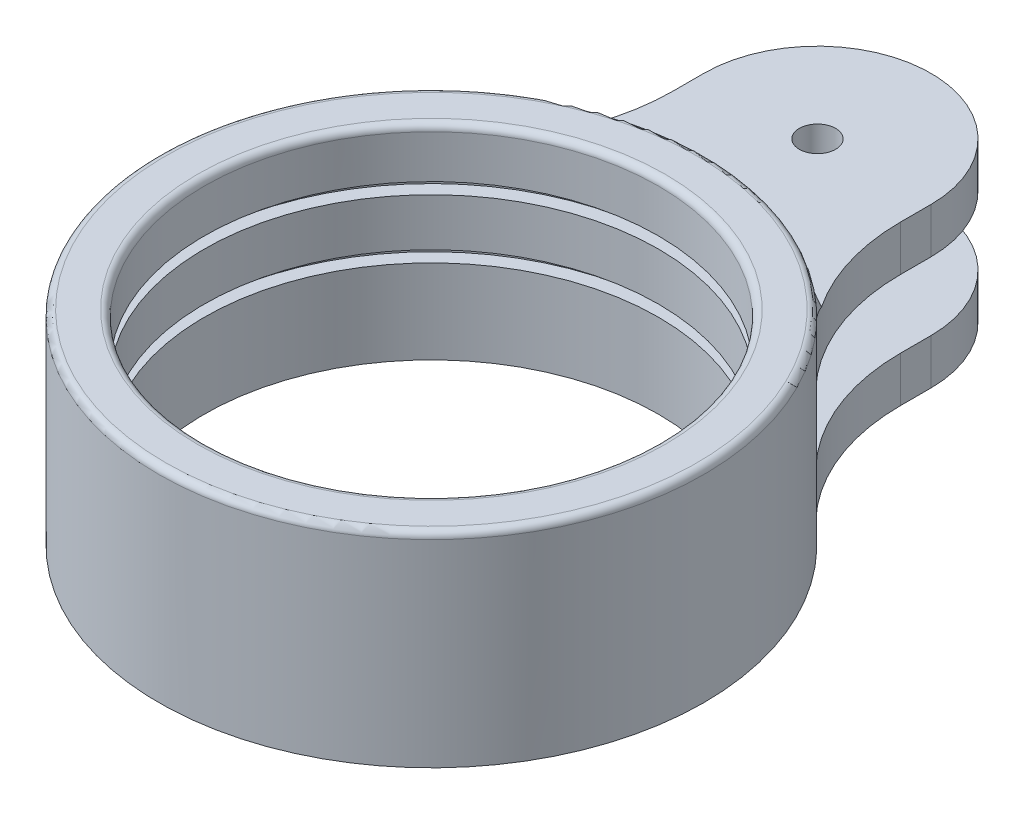
ISO-10303-21;
HEADER;
FILE_DESCRIPTION(('STEP AP214'),'2;1');
FILE_NAME('part.step','',(''),(''),'','','');
FILE_SCHEMA(('AUTOMOTIVE_DESIGN { 1 0 10303 214 1 1 1 1 }'));
ENDSEC;
DATA;
#1=APPLICATION_CONTEXT('core data for automotive mechanical design processes');
#2=APPLICATION_PROTOCOL_DEFINITION('international standard','automotive_design',2000,#1);
#3=PRODUCT_CONTEXT('',#1,'mechanical');
#4=PRODUCT('Part','Part','',(#3));
#5=PRODUCT_RELATED_PRODUCT_CATEGORY('part','',(#4));
#6=PRODUCT_DEFINITION_FORMATION('','',#4);
#7=PRODUCT_DEFINITION_CONTEXT('part definition',#1,'design');
#8=PRODUCT_DEFINITION('design','',#6,#7);
#9=PRODUCT_DEFINITION_SHAPE('','',#8);
#10=(LENGTH_UNIT() NAMED_UNIT(*) SI_UNIT(.MILLI.,.METRE.));
#11=(NAMED_UNIT(*) PLANE_ANGLE_UNIT() SI_UNIT($,.RADIAN.));
#12=(NAMED_UNIT(*) SI_UNIT($,.STERADIAN.) SOLID_ANGLE_UNIT());
#13=UNCERTAINTY_MEASURE_WITH_UNIT(LENGTH_MEASURE(1.E-05),#10,'distance_accuracy_value','');
#14=(GEOMETRIC_REPRESENTATION_CONTEXT(3) GLOBAL_UNCERTAINTY_ASSIGNED_CONTEXT((#13)) GLOBAL_UNIT_ASSIGNED_CONTEXT((#10,
#11,#12)) REPRESENTATION_CONTEXT('',''));
#15=CARTESIAN_POINT('',(0.,0.,0.));
#16=DIRECTION('',(0.,0.,1.));
#17=DIRECTION('',(1.,0.,0.));
#18=AXIS2_PLACEMENT_3D('',#15,#16,#17);
#19=CARTESIAN_POINT('',(0.,45.,0.));
#20=DIRECTION('',(0.,-1.,0.));
#21=DIRECTION('',(0.,0.,-1.));
#22=AXIS2_PLACEMENT_3D('',#19,#20,#21);
#23=CYLINDRICAL_SURFACE('',#22,50.);
#24=CARTESIAN_POINT('',(0.,21.,0.));
#25=DIRECTION('',(0.,1.,0.));
#26=DIRECTION('',(0.,0.,1.));
#27=AXIS2_PLACEMENT_3D('',#24,#25,#26);
#28=CIRCLE('',#27,50.);
#29=CARTESIAN_POINT('',(0.,21.,-50.));
#30=VERTEX_POINT('',#29);
#31=EDGE_CURVE('E267',#30,#30,#28,.T.);
#32=CARTESIAN_POINT('',(0.,31.5,0.));
#33=DIRECTION('',(0.,1.,0.));
#34=DIRECTION('',(0.,0.,1.));
#35=AXIS2_PLACEMENT_3D('',#32,#33,#34);
#36=CIRCLE('',#35,50.);
#37=CARTESIAN_POINT('',(0.,31.5,-50.));
#38=VERTEX_POINT('',#37);
#39=EDGE_CURVE('E248',#38,#38,#36,.T.);
#40=CARTESIAN_POINT('',(0.,21.,-50.));
#41=CARTESIAN_POINT('',(0.,21.109375,-50.));
#42=CARTESIAN_POINT('',(0.,21.21875,-50.));
#43=CARTESIAN_POINT('',(0.,21.4375,-50.));
#44=CARTESIAN_POINT('',(0.,21.546875,-50.));
#45=CARTESIAN_POINT('',(0.,21.765625,-50.));
#46=CARTESIAN_POINT('',(0.,21.875,-50.));
#47=CARTESIAN_POINT('',(0.,22.09375,-50.));
#48=CARTESIAN_POINT('',(0.,22.203125,-50.));
#49=CARTESIAN_POINT('',(0.,22.421875,-50.));
#50=CARTESIAN_POINT('',(0.,22.53125,-50.));
#51=CARTESIAN_POINT('',(0.,22.75,-50.));
#52=CARTESIAN_POINT('',(0.,22.859375,-50.));
#53=CARTESIAN_POINT('',(0.,23.078125,-50.));
#54=CARTESIAN_POINT('',(0.,23.1875,-50.));
#55=CARTESIAN_POINT('',(0.,23.40625,-50.));
#56=CARTESIAN_POINT('',(0.,23.515625,-50.));
#57=CARTESIAN_POINT('',(0.,23.734375,-50.));
#58=CARTESIAN_POINT('',(0.,23.84375,-50.));
#59=CARTESIAN_POINT('',(0.,24.0625,-50.));
#60=CARTESIAN_POINT('',(0.,24.171875,-50.));
#61=CARTESIAN_POINT('',(0.,24.390625,-50.));
#62=CARTESIAN_POINT('',(0.,24.5,-50.));
#63=CARTESIAN_POINT('',(0.,24.71875,-50.));
#64=CARTESIAN_POINT('',(0.,24.828125,-50.));
#65=CARTESIAN_POINT('',(0.,25.046875,-50.));
#66=CARTESIAN_POINT('',(0.,25.15625,-50.));
#67=CARTESIAN_POINT('',(0.,25.375,-50.));
#68=CARTESIAN_POINT('',(0.,25.484375,-50.));
#69=CARTESIAN_POINT('',(0.,25.703125,-50.));
#70=CARTESIAN_POINT('',(0.,25.8125,-50.));
#71=CARTESIAN_POINT('',(0.,26.03125,-50.));
#72=CARTESIAN_POINT('',(0.,26.140625,-50.));
#73=CARTESIAN_POINT('',(0.,26.359375,-50.));
#74=CARTESIAN_POINT('',(0.,26.46875,-50.));
#75=CARTESIAN_POINT('',(0.,26.6875,-50.));
#76=CARTESIAN_POINT('',(0.,26.796875,-50.));
#77=CARTESIAN_POINT('',(0.,27.015625,-50.));
#78=CARTESIAN_POINT('',(0.,27.125,-50.));
#79=CARTESIAN_POINT('',(0.,27.34375,-50.));
#80=CARTESIAN_POINT('',(0.,27.453125,-50.));
#81=CARTESIAN_POINT('',(0.,27.671875,-50.));
#82=CARTESIAN_POINT('',(0.,27.78125,-50.));
#83=CARTESIAN_POINT('',(0.,28.,-50.));
#84=CARTESIAN_POINT('',(0.,28.109375,-50.));
#85=CARTESIAN_POINT('',(0.,28.328125,-50.));
#86=CARTESIAN_POINT('',(0.,28.4375,-50.));
#87=CARTESIAN_POINT('',(0.,28.65625,-50.));
#88=CARTESIAN_POINT('',(0.,28.765625,-50.));
#89=CARTESIAN_POINT('',(0.,28.984375,-50.));
#90=CARTESIAN_POINT('',(0.,29.09375,-50.));
#91=CARTESIAN_POINT('',(0.,29.3125,-50.));
#92=CARTESIAN_POINT('',(0.,29.421875,-50.));
#93=CARTESIAN_POINT('',(0.,29.640625,-50.));
#94=CARTESIAN_POINT('',(0.,29.75,-50.));
#95=CARTESIAN_POINT('',(0.,29.96875,-50.));
#96=CARTESIAN_POINT('',(0.,30.078125,-50.));
#97=CARTESIAN_POINT('',(0.,30.296875,-50.));
#98=CARTESIAN_POINT('',(0.,30.40625,-50.));
#99=CARTESIAN_POINT('',(0.,30.625,-50.));
#100=CARTESIAN_POINT('',(0.,30.734375,-50.));
#101=CARTESIAN_POINT('',(0.,30.953125,-50.));
#102=CARTESIAN_POINT('',(0.,31.0625,-50.));
#103=CARTESIAN_POINT('',(0.,31.28125,-50.));
#104=CARTESIAN_POINT('',(0.,31.390625,-50.));
#105=CARTESIAN_POINT('',(0.,31.5,-50.));
#106=B_SPLINE_CURVE_WITH_KNOTS('',3,(#40,#41,#42,#43,#44,#45,#46,#47,#48,#49,#50,#51,#52,#53,
#54,#55,#56,#57,#58,#59,#60,#61,#62,#63,#64,#65,#66,#67,#68,#69,#70,#71,#72,#73,#74,#75,#76,#77,
#78,#79,#80,#81,#82,#83,#84,#85,#86,#87,#88,#89,#90,#91,#92,#93,#94,#95,#96,#97,#98,#99,#100,
#101,#102,#103,#104,#105),.UNSPECIFIED.,.F.,.F.,(4,2,2,2,2,2,2,2,2,2,2,2,2,2,2,2,2,2,2,2,2,2,2,
2,2,2,2,2,2,2,2,2,4),(0.,0.328124999999999,0.656250000000001,0.984374999999999,1.3125,1.640625,
1.96875,2.296875,2.625,2.953125,3.28125,3.609375,3.9375,4.265625,4.59375,4.921875,5.25,5.578125,
5.90625,6.234375,6.5625,6.890625,7.21875,7.546875,7.875,8.203125,8.53125,8.859375,9.1875,
9.515625,9.84375,10.171875,10.5),.UNSPECIFIED.);
#107=EDGE_CURVE('BSEAM37',#30,#38,#106,.T.);
#108=ORIENTED_EDGE('',*,*,#31,.F.);
#109=ORIENTED_EDGE('',*,*,#39,.T.);
#110=ORIENTED_EDGE('',*,*,#107,.T.);
#111=ORIENTED_EDGE('',*,*,#107,.F.);
#112=EDGE_LOOP('',(#108,#110,#109,#111));
#113=FACE_BOUND('',#112,.T.);
#114=ADVANCED_FACE('F37',(#113),#23,.F.);
#115=CARTESIAN_POINT('',(0.,0.,0.));
#116=DIRECTION('',(0.,1.,0.));
#117=DIRECTION('',(0.,0.,1.));
#118=AXIS2_PLACEMENT_3D('',#115,#116,#117);
#119=CIRCLE('',#118,50.);
#120=CARTESIAN_POINT('',(0.,0.,-50.));
#121=VERTEX_POINT('',#120);
#122=EDGE_CURVE('E322',#121,#121,#119,.T.);
#123=CARTESIAN_POINT('',(0.,18.5,0.));
#124=DIRECTION('',(0.,1.,0.));
#125=DIRECTION('',(0.,0.,1.));
#126=AXIS2_PLACEMENT_3D('',#123,#124,#125);
#127=CIRCLE('',#126,50.);
#128=CARTESIAN_POINT('',(0.,18.5,-50.));
#129=VERTEX_POINT('',#128);
#130=EDGE_CURVE('E264',#129,#129,#127,.T.);
#131=CARTESIAN_POINT('',(0.,0.,-50.));
#132=CARTESIAN_POINT('',(0.,0.192708333333326,-50.));
#133=CARTESIAN_POINT('',(0.,0.385416666666659,-50.));
#134=CARTESIAN_POINT('',(0.,0.770833333333325,-50.));
#135=CARTESIAN_POINT('',(0.,0.963541666666658,-50.));
#136=CARTESIAN_POINT('',(0.,1.34895833333333,-50.));
#137=CARTESIAN_POINT('',(0.,1.54166666666666,-50.));
#138=CARTESIAN_POINT('',(0.,1.92708333333333,-50.));
#139=CARTESIAN_POINT('',(0.,2.11979166666666,-50.));
#140=CARTESIAN_POINT('',(0.,2.50520833333333,-50.));
#141=CARTESIAN_POINT('',(0.,2.69791666666666,-50.));
#142=CARTESIAN_POINT('',(0.,3.08333333333333,-50.));
#143=CARTESIAN_POINT('',(0.,3.27604166666666,-50.));
#144=CARTESIAN_POINT('',(0.,3.66145833333333,-50.));
#145=CARTESIAN_POINT('',(0.,3.85416666666666,-50.));
#146=CARTESIAN_POINT('',(0.,4.23958333333333,-50.));
#147=CARTESIAN_POINT('',(0.,4.43229166666666,-50.));
#148=CARTESIAN_POINT('',(0.,4.81770833333333,-50.));
#149=CARTESIAN_POINT('',(0.,5.01041666666666,-50.));
#150=CARTESIAN_POINT('',(0.,5.39583333333333,-50.));
#151=CARTESIAN_POINT('',(0.,5.58854166666666,-50.));
#152=CARTESIAN_POINT('',(0.,5.97395833333333,-50.));
#153=CARTESIAN_POINT('',(0.,6.16666666666666,-50.));
#154=CARTESIAN_POINT('',(0.,6.55208333333333,-50.));
#155=CARTESIAN_POINT('',(0.,6.74479166666666,-50.));
#156=CARTESIAN_POINT('',(0.,7.13020833333333,-50.));
#157=CARTESIAN_POINT('',(0.,7.32291666666667,-50.));
#158=CARTESIAN_POINT('',(0.,7.70833333333333,-50.));
#159=CARTESIAN_POINT('',(0.,7.90104166666666,-50.));
#160=CARTESIAN_POINT('',(0.,8.28645833333333,-50.));
#161=CARTESIAN_POINT('',(0.,8.47916666666666,-50.));
#162=CARTESIAN_POINT('',(0.,8.86458333333333,-50.));
#163=CARTESIAN_POINT('',(0.,9.05729166666667,-50.));
#164=CARTESIAN_POINT('',(0.,9.44270833333333,-50.));
#165=CARTESIAN_POINT('',(0.,9.63541666666667,-50.));
#166=CARTESIAN_POINT('',(0.,10.0208333333333,-50.));
#167=CARTESIAN_POINT('',(0.,10.2135416666667,-50.));
#168=CARTESIAN_POINT('',(0.,10.5989583333333,-50.));
#169=CARTESIAN_POINT('',(0.,10.7916666666667,-50.));
#170=CARTESIAN_POINT('',(0.,11.1770833333333,-50.));
#171=CARTESIAN_POINT('',(0.,11.3697916666667,-50.));
#172=CARTESIAN_POINT('',(0.,11.7552083333333,-50.));
#173=CARTESIAN_POINT('',(0.,11.9479166666667,-50.));
#174=CARTESIAN_POINT('',(0.,12.3333333333333,-50.));
#175=CARTESIAN_POINT('',(0.,12.5260416666667,-50.));
#176=CARTESIAN_POINT('',(0.,12.9114583333333,-50.));
#177=CARTESIAN_POINT('',(0.,13.1041666666667,-50.));
#178=CARTESIAN_POINT('',(0.,13.4895833333333,-50.));
#179=CARTESIAN_POINT('',(0.,13.6822916666667,-50.));
#180=CARTESIAN_POINT('',(0.,14.0677083333333,-50.));
#181=CARTESIAN_POINT('',(0.,14.2604166666667,-50.));
#182=CARTESIAN_POINT('',(0.,14.6458333333333,-50.));
#183=CARTESIAN_POINT('',(0.,14.8385416666667,-50.));
#184=CARTESIAN_POINT('',(0.,15.2239583333333,-50.));
#185=CARTESIAN_POINT('',(0.,15.4166666666667,-50.));
#186=CARTESIAN_POINT('',(0.,15.8020833333333,-50.));
#187=CARTESIAN_POINT('',(0.,15.9947916666667,-50.));
#188=CARTESIAN_POINT('',(0.,16.3802083333333,-50.));
#189=CARTESIAN_POINT('',(0.,16.5729166666667,-50.));
#190=CARTESIAN_POINT('',(0.,16.9583333333333,-50.));
#191=CARTESIAN_POINT('',(0.,17.1510416666667,-50.));
#192=CARTESIAN_POINT('',(0.,17.5364583333333,-50.));
#193=CARTESIAN_POINT('',(0.,17.7291666666667,-50.));
#194=CARTESIAN_POINT('',(0.,18.1145833333333,-50.));
#195=CARTESIAN_POINT('',(0.,18.3072916666667,-50.));
#196=CARTESIAN_POINT('',(0.,18.5,-50.));
#197=B_SPLINE_CURVE_WITH_KNOTS('',3,(#131,#132,#133,#134,#135,#136,#137,#138,#139,#140,#141,
#142,#143,#144,#145,#146,#147,#148,#149,#150,#151,#152,#153,#154,#155,#156,#157,#158,#159,#160,
#161,#162,#163,#164,#165,#166,#167,#168,#169,#170,#171,#172,#173,#174,#175,#176,#177,#178,#179,
#180,#181,#182,#183,#184,#185,#186,#187,#188,#189,#190,#191,#192,#193,#194,#195,#196),
.UNSPECIFIED.,.F.,.F.,(4,2,2,2,2,2,2,2,2,2,2,2,2,2,2,2,2,2,2,2,2,2,2,2,2,2,2,2,2,2,2,2,4),(0.,
0.578124999999999,1.15625,1.734375,2.3125,2.890625,3.46875,4.04687500000001,4.625,5.203125,
5.78125,6.359375,6.93750000000001,7.51562500000001,8.09375,8.671875,9.25000000000001,
9.82812500000001,10.40625,10.984375,11.5625,12.140625,12.71875,13.296875,13.875,14.453125,
15.03125,15.609375,16.1875,16.765625,17.34375,17.921875,18.5),.UNSPECIFIED.);
#198=EDGE_CURVE('BSEAM215',#121,#129,#197,.T.);
#199=ORIENTED_EDGE('',*,*,#122,.F.);
#200=ORIENTED_EDGE('',*,*,#130,.T.);
#201=ORIENTED_EDGE('',*,*,#198,.T.);
#202=ORIENTED_EDGE('',*,*,#198,.F.);
#203=EDGE_LOOP('',(#199,#201,#200,#202));
#204=FACE_BOUND('',#203,.T.);
#205=ADVANCED_FACE('F215',(#204),#23,.F.);
#206=CARTESIAN_POINT('',(0.,35.,-85.));
#207=DIRECTION('',(0.,-1.,0.));
#208=DIRECTION('',(0.,0.,-1.));
#209=AXIS2_PLACEMENT_3D('',#206,#207,#208);
#210=CYLINDRICAL_SURFACE('',#209,25.);
#211=CARTESIAN_POINT('',(0.,10.,-85.));
#212=DIRECTION('',(0.,1.,0.));
#213=DIRECTION('',(0.,0.,1.));
#214=AXIS2_PLACEMENT_3D('',#211,#212,#213);
#215=CIRCLE('',#214,25.);
#216=CARTESIAN_POINT('',(25.,10.,-85.));
#217=VERTEX_POINT('',#216);
#218=CARTESIAN_POINT('',(-25.,10.,-85.));
#219=VERTEX_POINT('',#218);
#220=EDGE_CURVE('E285',#217,#219,#215,.T.);
#221=ORIENTED_EDGE('',*,*,#220,.F.);
#222=DIRECTION('',(0.,-1.,0.));
#223=VECTOR('',#222,1.);
#224=CARTESIAN_POINT('',(25.,35.,-85.));
#225=LINE('',#224,#223);
#226=CARTESIAN_POINT('',(25.,0.,-85.));
#227=VERTEX_POINT('',#226);
#228=EDGE_CURVE('E307',#217,#227,#225,.T.);
#229=ORIENTED_EDGE('',*,*,#228,.T.);
#230=CARTESIAN_POINT('',(0.,0.,-85.));
#231=DIRECTION('',(0.,1.,0.));
#232=DIRECTION('',(0.,0.,1.));
#233=AXIS2_PLACEMENT_3D('',#230,#231,#232);
#234=CIRCLE('',#233,25.);
#235=CARTESIAN_POINT('',(-25.,0.,-85.));
#236=VERTEX_POINT('',#235);
#237=EDGE_CURVE('E146',#227,#236,#234,.T.);
#238=ORIENTED_EDGE('',*,*,#237,.T.);
#239=DIRECTION('',(0.,-1.,0.));
#240=VECTOR('',#239,1.);
#241=CARTESIAN_POINT('',(-25.,35.,-85.));
#242=LINE('',#241,#240);
#243=EDGE_CURVE('E318',#219,#236,#242,.T.);
#244=ORIENTED_EDGE('',*,*,#243,.F.);
#245=EDGE_LOOP('',(#221,#229,#238,#244));
#246=FACE_BOUND('',#245,.T.);
#247=ADVANCED_FACE('F222',(#246),#210,.T.);
#248=CARTESIAN_POINT('',(-25.,35.,-85.));
#249=DIRECTION('',(1.,0.,0.));
#250=DIRECTION('',(0.,0.,-1.));
#251=AXIS2_PLACEMENT_3D('',#248,#249,#250);
#252=PLANE('',#251);
#253=DIRECTION('',(0.,0.,1.));
#254=VECTOR('',#253,1.);
#255=CARTESIAN_POINT('',(-25.,10.,-85.));
#256=LINE('',#255,#254);
#257=CARTESIAN_POINT('',(-25.,10.,-78.2623792124926));
#258=VERTEX_POINT('',#257);
#259=EDGE_CURVE('E287',#219,#258,#256,.T.);
#260=ORIENTED_EDGE('',*,*,#259,.F.);
#261=ORIENTED_EDGE('',*,*,#243,.T.);
#262=DIRECTION('',(0.,0.,1.));
#263=VECTOR('',#262,1.);
#264=CARTESIAN_POINT('',(-25.,0.,-85.));
#265=LINE('',#264,#263);
#266=CARTESIAN_POINT('',(-25.,0.,-78.2623792124926));
#267=VERTEX_POINT('',#266);
#268=EDGE_CURVE('E310',#236,#267,#265,.T.);
#269=ORIENTED_EDGE('',*,*,#268,.T.);
#270=DIRECTION('',(0.,1.,0.));
#271=VECTOR('',#270,1.);
#272=CARTESIAN_POINT('',(-25.,35.,-78.2623792124926));
#273=LINE('',#272,#271);
#274=EDGE_CURVE('E156',#267,#258,#273,.T.);
#275=ORIENTED_EDGE('',*,*,#274,.T.);
#276=EDGE_LOOP('',(#260,#261,#269,#275));
#277=FACE_BOUND('',#276,.T.);
#278=ADVANCED_FACE('F351',(#277),#252,.F.);
#279=CARTESIAN_POINT('',(25.,35.,-85.));
#280=DIRECTION('',(-1.,0.,0.));
#281=DIRECTION('',(0.,0.,1.));
#282=AXIS2_PLACEMENT_3D('',#279,#280,#281);
#283=PLANE('',#282);
#284=DIRECTION('',(0.,0.,-1.));
#285=VECTOR('',#284,1.);
#286=CARTESIAN_POINT('',(25.,10.,-85.));
#287=LINE('',#286,#285);
#288=CARTESIAN_POINT('',(25.,10.,-78.2623792124926));
#289=VERTEX_POINT('',#288);
#290=EDGE_CURVE('E139',#289,#217,#287,.T.);
#291=ORIENTED_EDGE('',*,*,#290,.F.);
#292=DIRECTION('',(0.,1.,0.));
#293=VECTOR('',#292,1.);
#294=CARTESIAN_POINT('',(25.,0.,-78.2623792124926));
#295=LINE('',#294,#293);
#296=CARTESIAN_POINT('',(25.,0.,-78.2623792124926));
#297=VERTEX_POINT('',#296);
#298=EDGE_CURVE('E163',#289,#297,#295,.F.);
#299=ORIENTED_EDGE('',*,*,#298,.T.);
#300=DIRECTION('',(0.,0.,-1.));
#301=VECTOR('',#300,1.);
#302=CARTESIAN_POINT('',(25.,0.,-85.));
#303=LINE('',#302,#301);
#304=EDGE_CURVE('E302',#297,#227,#303,.T.);
#305=ORIENTED_EDGE('',*,*,#304,.T.);
#306=ORIENTED_EDGE('',*,*,#228,.F.);
#307=EDGE_LOOP('',(#291,#299,#305,#306));
#308=FACE_BOUND('',#307,.T.);
#309=ADVANCED_FACE('F344',(#308),#283,.F.);
#310=CARTESIAN_POINT('',(-70.,45.,-78.2623792124926));
#311=DIRECTION('',(0.,-1.,0.));
#312=DIRECTION('',(0.,0.,-1.));
#313=AXIS2_PLACEMENT_3D('',#310,#311,#312);
#314=CYLINDRICAL_SURFACE('',#313,45.);
#315=CARTESIAN_POINT('',(-70.,10.,-78.2623792124926));
#316=DIRECTION('',(0.,1.,0.));
#317=DIRECTION('',(0.,0.,1.));
#318=AXIS2_PLACEMENT_3D('',#315,#316,#317);
#319=CIRCLE('',#318,45.);
#320=CARTESIAN_POINT('',(-40.,10.,-44.7213595499958));
#321=VERTEX_POINT('',#320);
#322=EDGE_CURVE('E289',#258,#321,#319,.F.);
#323=ORIENTED_EDGE('',*,*,#322,.F.);
#324=ORIENTED_EDGE('',*,*,#274,.F.);
#325=CARTESIAN_POINT('',(-70.,0.,-78.2623792124926));
#326=DIRECTION('',(0.,1.,0.));
#327=DIRECTION('',(0.,0.,1.));
#328=AXIS2_PLACEMENT_3D('',#325,#326,#327);
#329=CIRCLE('',#328,45.);
#330=CARTESIAN_POINT('',(-40.,0.,-44.7213595499958));
#331=VERTEX_POINT('',#330);
#332=EDGE_CURVE('E167',#331,#267,#329,.T.);
#333=ORIENTED_EDGE('',*,*,#332,.F.);
#334=DIRECTION('',(0.,-1.,0.));
#335=VECTOR('',#334,1.);
#336=CARTESIAN_POINT('',(-40.,45.,-44.7213595499958));
#337=LINE('',#336,#335);
#338=EDGE_CURVE('E154',#321,#331,#337,.T.);
#339=ORIENTED_EDGE('',*,*,#338,.F.);
#340=EDGE_LOOP('',(#323,#324,#333,#339));
#341=FACE_BOUND('',#340,.T.);
#342=ADVANCED_FACE('F356',(#341),#314,.F.);
#343=CARTESIAN_POINT('',(70.,45.,-78.2623792124926));
#344=DIRECTION('',(0.,-1.,0.));
#345=DIRECTION('',(0.,0.,-1.));
#346=AXIS2_PLACEMENT_3D('',#343,#344,#345);
#347=CYLINDRICAL_SURFACE('',#346,45.);
#348=CARTESIAN_POINT('',(70.,10.,-78.2623792124926));
#349=DIRECTION('',(0.,1.,0.));
#350=DIRECTION('',(0.,0.,1.));
#351=AXIS2_PLACEMENT_3D('',#348,#349,#350);
#352=CIRCLE('',#351,45.);
#353=CARTESIAN_POINT('',(40.,10.,-44.7213595499958));
#354=VERTEX_POINT('',#353);
#355=EDGE_CURVE('E176',#354,#289,#352,.F.);
#356=ORIENTED_EDGE('',*,*,#355,.F.);
#357=DIRECTION('',(0.,-1.,0.));
#358=VECTOR('',#357,1.);
#359=CARTESIAN_POINT('',(40.,45.,-44.7213595499958));
#360=LINE('',#359,#358);
#361=CARTESIAN_POINT('',(40.,0.,-44.7213595499958));
#362=VERTEX_POINT('',#361);
#363=EDGE_CURVE('E158',#362,#354,#360,.F.);
#364=ORIENTED_EDGE('',*,*,#363,.F.);
#365=CARTESIAN_POINT('',(70.,0.,-78.2623792124926));
#366=DIRECTION('',(0.,1.,0.));
#367=DIRECTION('',(0.,0.,1.));
#368=AXIS2_PLACEMENT_3D('',#365,#366,#367);
#369=CIRCLE('',#368,45.);
#370=EDGE_CURVE('E172',#297,#362,#369,.T.);
#371=ORIENTED_EDGE('',*,*,#370,.F.);
#372=ORIENTED_EDGE('',*,*,#298,.F.);
#373=EDGE_LOOP('',(#356,#364,#371,#372));
#374=FACE_BOUND('',#373,.T.);
#375=ADVANCED_FACE('F335',(#374),#347,.F.);
#376=CARTESIAN_POINT('',(0.,45.,0.));
#377=DIRECTION('',(0.,-1.,0.));
#378=DIRECTION('',(0.,0.,-1.));
#379=AXIS2_PLACEMENT_3D('',#376,#377,#378);
#380=CYLINDRICAL_SURFACE('',#379,60.);
#381=CARTESIAN_POINT('',(0.,43.5,0.));
#382=DIRECTION('',(0.,1.,0.));
#383=DIRECTION('',(0.,0.,1.));
#384=AXIS2_PLACEMENT_3D('',#381,#382,#383);
#385=CIRCLE('',#384,60.);
#386=CARTESIAN_POINT('',(0.,43.5,60.));
#387=VERTEX_POINT('',#386);
#388=EDGE_CURVE('E46',#387,#387,#385,.F.);
#389=ORIENTED_EDGE('',*,*,#388,.T.);
#390=EDGE_LOOP('',(#389));
#391=FACE_BOUND('',#390,.T.);
#392=CARTESIAN_POINT('',(40.,25.,-44.7213595499958));
#393=VERTEX_POINT('',#392);
#394=CARTESIAN_POINT('',(40.,37.4999999999999,-44.7213595499958));
#395=VERTEX_POINT('',#394);
#396=EDGE_CURVE('E53',#393,#395,#360,.F.);
#397=ORIENTED_EDGE('',*,*,#396,.T.);
#398=CARTESIAN_POINT('',(0.,37.4999999999999,0.));
#399=DIRECTION('',(0.,1.,0.));
#400=DIRECTION('',(0.,0.,1.));
#401=AXIS2_PLACEMENT_3D('',#398,#399,#400);
#402=CIRCLE('',#401,60.);
#403=CARTESIAN_POINT('',(-40.,37.4999999999999,-44.7213595499958));
#404=VERTEX_POINT('',#403);
#405=EDGE_CURVE('E152',#395,#404,#402,.T.);
#406=ORIENTED_EDGE('',*,*,#405,.T.);
#407=CARTESIAN_POINT('',(-40.,25.,-44.7213595499958));
#408=VERTEX_POINT('',#407);
#409=EDGE_CURVE('E61',#404,#408,#337,.T.);
#410=ORIENTED_EDGE('',*,*,#409,.T.);
#411=CARTESIAN_POINT('',(0.,25.,0.));
#412=DIRECTION('',(0.,1.,0.));
#413=DIRECTION('',(0.,0.,1.));
#414=AXIS2_PLACEMENT_3D('',#411,#412,#413);
#415=CIRCLE('',#414,60.);
#416=EDGE_CURVE('E133',#393,#408,#415,.T.);
#417=ORIENTED_EDGE('',*,*,#416,.F.);
#418=EDGE_LOOP('',(#397,#406,#410,#417));
#419=FACE_BOUND('',#418,.T.);
#420=ORIENTED_EDGE('',*,*,#363,.T.);
#421=CARTESIAN_POINT('',(0.,10.,0.));
#422=DIRECTION('',(0.,1.,0.));
#423=DIRECTION('',(0.,0.,1.));
#424=AXIS2_PLACEMENT_3D('',#421,#422,#423);
#425=CIRCLE('',#424,60.);
#426=EDGE_CURVE('E140',#354,#321,#425,.T.);
#427=ORIENTED_EDGE('',*,*,#426,.T.);
#428=ORIENTED_EDGE('',*,*,#338,.T.);
#429=CARTESIAN_POINT('',(0.,0.,0.));
#430=DIRECTION('',(0.,1.,0.));
#431=DIRECTION('',(0.,0.,1.));
#432=AXIS2_PLACEMENT_3D('',#429,#430,#431);
#433=CIRCLE('',#432,60.);
#434=EDGE_CURVE('E325',#331,#362,#433,.T.);
#435=ORIENTED_EDGE('',*,*,#434,.T.);
#436=EDGE_LOOP('',(#420,#427,#428,#435));
#437=FACE_BOUND('',#436,.T.);
#438=ADVANCED_FACE('F149',(#391,#419,#437),#380,.T.);
#439=CARTESIAN_POINT('',(0.,45.,0.));
#440=DIRECTION('',(0.,1.,0.));
#441=DIRECTION('',(0.,0.,1.));
#442=AXIS2_PLACEMENT_3D('',#439,#440,#441);
#443=PLANE('',#442);
#444=CARTESIAN_POINT('',(0.,45.,0.));
#445=DIRECTION('',(0.,1.,0.));
#446=DIRECTION('',(0.,0.,1.));
#447=AXIS2_PLACEMENT_3D('',#444,#445,#446);
#448=CIRCLE('',#447,58.5);
#449=CARTESIAN_POINT('',(0.,45.,58.5));
#450=VERTEX_POINT('',#449);
#451=EDGE_CURVE('E570',#450,#450,#448,.T.);
#452=ORIENTED_EDGE('',*,*,#451,.T.);
#453=EDGE_LOOP('',(#452));
#454=FACE_BOUND('',#453,.T.);
#455=CARTESIAN_POINT('',(0.,45.,0.));
#456=DIRECTION('',(0.,1.,0.));
#457=DIRECTION('',(0.,0.,1.));
#458=AXIS2_PLACEMENT_3D('',#455,#456,#457);
#459=CIRCLE('',#458,51.5);
#460=CARTESIAN_POINT('',(0.,45.,51.5));
#461=VERTEX_POINT('',#460);
#462=EDGE_CURVE('E573',#461,#461,#459,.F.);
#463=ORIENTED_EDGE('',*,*,#462,.T.);
#464=EDGE_LOOP('',(#463));
#465=FACE_BOUND('',#464,.T.);
#466=ADVANCED_FACE('F238',(#454,#465),#443,.T.);
#467=CARTESIAN_POINT('',(0.,0.,0.));
#468=DIRECTION('',(0.,1.,0.));
#469=DIRECTION('',(0.,0.,1.));
#470=AXIS2_PLACEMENT_3D('',#467,#468,#469);
#471=PLANE('',#470);
#472=CARTESIAN_POINT('',(0.,0.,-85.));
#473=DIRECTION('',(0.,-1.,0.));
#474=DIRECTION('',(0.,0.,-1.));
#475=AXIS2_PLACEMENT_3D('',#472,#473,#474);
#476=CIRCLE('',#475,4.);
#477=CARTESIAN_POINT('',(0.,0.,-89.));
#478=VERTEX_POINT('',#477);
#479=EDGE_CURVE('E631',#478,#478,#476,.T.);
#480=ORIENTED_EDGE('',*,*,#479,.F.);
#481=EDGE_LOOP('',(#480));
#482=FACE_BOUND('',#481,.T.);
#483=ORIENTED_EDGE('',*,*,#434,.F.);
#484=ORIENTED_EDGE('',*,*,#332,.T.);
#485=ORIENTED_EDGE('',*,*,#268,.F.);
#486=ORIENTED_EDGE('',*,*,#237,.F.);
#487=ORIENTED_EDGE('',*,*,#304,.F.);
#488=ORIENTED_EDGE('',*,*,#370,.T.);
#489=EDGE_LOOP('',(#483,#484,#485,#486,#487,#488));
#490=FACE_BOUND('',#489,.T.);
#491=ORIENTED_EDGE('',*,*,#122,.T.);
#492=EDGE_LOOP('',(#491));
#493=FACE_BOUND('',#492,.T.);
#494=ADVANCED_FACE('F230',(#482,#490,#493),#471,.F.);
#495=CARTESIAN_POINT('',(0.,43.5,0.));
#496=DIRECTION('',(0.,1.,0.));
#497=DIRECTION('',(0.,0.,1.));
#498=AXIS2_PLACEMENT_3D('',#495,#496,#497);
#499=CIRCLE('',#498,50.);
#500=CARTESIAN_POINT('',(0.,43.5,-50.));
#501=VERTEX_POINT('',#500);
#502=EDGE_CURVE('E11',#501,#501,#499,.T.);
#503=CARTESIAN_POINT('',(0.,34.,0.));
#504=DIRECTION('',(0.,1.,0.));
#505=DIRECTION('',(0.,0.,1.));
#506=AXIS2_PLACEMENT_3D('',#503,#504,#505);
#507=CIRCLE('',#506,50.);
#508=CARTESIAN_POINT('',(0.,34.,-50.));
#509=VERTEX_POINT('',#508);
#510=EDGE_CURVE('E245',#509,#509,#507,.T.);
#511=CARTESIAN_POINT('',(0.,43.5,-50.));
#512=CARTESIAN_POINT('',(0.,43.4010416666667,-50.));
#513=CARTESIAN_POINT('',(0.,43.3020833333333,-50.));
#514=CARTESIAN_POINT('',(0.,43.1041666666667,-50.));
#515=CARTESIAN_POINT('',(0.,43.0052083333333,-50.));
#516=CARTESIAN_POINT('',(0.,42.8072916666667,-50.));
#517=CARTESIAN_POINT('',(0.,42.7083333333333,-50.));
#518=CARTESIAN_POINT('',(0.,42.5104166666667,-50.));
#519=CARTESIAN_POINT('',(0.,42.4114583333333,-50.));
#520=CARTESIAN_POINT('',(0.,42.2135416666667,-50.));
#521=CARTESIAN_POINT('',(0.,42.1145833333333,-50.));
#522=CARTESIAN_POINT('',(0.,41.9166666666667,-50.));
#523=CARTESIAN_POINT('',(0.,41.8177083333333,-50.));
#524=CARTESIAN_POINT('',(0.,41.6197916666667,-50.));
#525=CARTESIAN_POINT('',(0.,41.5208333333333,-50.));
#526=CARTESIAN_POINT('',(0.,41.3229166666667,-50.));
#527=CARTESIAN_POINT('',(0.,41.2239583333333,-50.));
#528=CARTESIAN_POINT('',(0.,41.0260416666667,-50.));
#529=CARTESIAN_POINT('',(0.,40.9270833333333,-50.));
#530=CARTESIAN_POINT('',(0.,40.7291666666667,-50.));
#531=CARTESIAN_POINT('',(0.,40.6302083333333,-50.));
#532=CARTESIAN_POINT('',(0.,40.4322916666667,-50.));
#533=CARTESIAN_POINT('',(0.,40.3333333333333,-50.));
#534=CARTESIAN_POINT('',(0.,40.1354166666667,-50.));
#535=CARTESIAN_POINT('',(0.,40.0364583333333,-50.));
#536=CARTESIAN_POINT('',(0.,39.8385416666667,-50.));
#537=CARTESIAN_POINT('',(0.,39.7395833333333,-50.));
#538=CARTESIAN_POINT('',(0.,39.5416666666667,-50.));
#539=CARTESIAN_POINT('',(0.,39.4427083333333,-50.));
#540=CARTESIAN_POINT('',(0.,39.2447916666667,-50.));
#541=CARTESIAN_POINT('',(0.,39.1458333333333,-50.));
#542=CARTESIAN_POINT('',(0.,38.9479166666667,-50.));
#543=CARTESIAN_POINT('',(0.,38.8489583333333,-50.));
#544=CARTESIAN_POINT('',(0.,38.6510416666667,-50.));
#545=CARTESIAN_POINT('',(0.,38.5520833333333,-50.));
#546=CARTESIAN_POINT('',(0.,38.3541666666667,-50.));
#547=CARTESIAN_POINT('',(0.,38.2552083333333,-50.));
#548=CARTESIAN_POINT('',(0.,38.0572916666667,-50.));
#549=CARTESIAN_POINT('',(0.,37.9583333333333,-50.));
#550=CARTESIAN_POINT('',(0.,37.7604166666667,-50.));
#551=CARTESIAN_POINT('',(0.,37.6614583333333,-50.));
#552=CARTESIAN_POINT('',(0.,37.4635416666667,-50.));
#553=CARTESIAN_POINT('',(0.,37.3645833333333,-50.));
#554=CARTESIAN_POINT('',(0.,37.1666666666667,-50.));
#555=CARTESIAN_POINT('',(0.,37.0677083333333,-50.));
#556=CARTESIAN_POINT('',(0.,36.8697916666667,-50.));
#557=CARTESIAN_POINT('',(0.,36.7708333333333,-50.));
#558=CARTESIAN_POINT('',(0.,36.5729166666667,-50.));
#559=CARTESIAN_POINT('',(0.,36.4739583333333,-50.));
#560=CARTESIAN_POINT('',(0.,36.2760416666667,-50.));
#561=CARTESIAN_POINT('',(0.,36.1770833333333,-50.));
#562=CARTESIAN_POINT('',(0.,35.9791666666667,-50.));
#563=CARTESIAN_POINT('',(0.,35.8802083333333,-50.));
#564=CARTESIAN_POINT('',(0.,35.6822916666667,-50.));
#565=CARTESIAN_POINT('',(0.,35.5833333333333,-50.));
#566=CARTESIAN_POINT('',(0.,35.3854166666667,-50.));
#567=CARTESIAN_POINT('',(0.,35.2864583333333,-50.));
#568=CARTESIAN_POINT('',(0.,35.0885416666667,-50.));
#569=CARTESIAN_POINT('',(0.,34.9895833333333,-50.));
#570=CARTESIAN_POINT('',(0.,34.7916666666667,-50.));
#571=CARTESIAN_POINT('',(0.,34.6927083333333,-50.));
#572=CARTESIAN_POINT('',(0.,34.4947916666667,-50.));
#573=CARTESIAN_POINT('',(0.,34.3958333333333,-50.));
#574=CARTESIAN_POINT('',(0.,34.1979166666667,-50.));
#575=CARTESIAN_POINT('',(0.,34.0989583333333,-50.));
#576=CARTESIAN_POINT('',(0.,34.,-50.));
#577=B_SPLINE_CURVE_WITH_KNOTS('',3,(#511,#512,#513,#514,#515,#516,#517,#518,#519,#520,#521,
#522,#523,#524,#525,#526,#527,#528,#529,#530,#531,#532,#533,#534,#535,#536,#537,#538,#539,#540,
#541,#542,#543,#544,#545,#546,#547,#548,#549,#550,#551,#552,#553,#554,#555,#556,#557,#558,#559,
#560,#561,#562,#563,#564,#565,#566,#567,#568,#569,#570,#571,#572,#573,#574,#575,#576),
.UNSPECIFIED.,.F.,.F.,(4,2,2,2,2,2,2,2,2,2,2,2,2,2,2,2,2,2,2,2,2,2,2,2,2,2,2,2,2,2,2,2,4),(0.,
0.296874999999995,0.593749999999997,0.890624999999999,1.18749999999999,1.484375,1.78125,
2.07812499999999,2.375,2.671875,2.96874999999999,3.26562499999999,3.5625,3.859375,
4.15624999999999,4.453125,4.75,5.04687499999999,5.34374999999999,5.640625,5.93749999999999,
6.23437499999999,6.53125,6.828125,7.12499999999999,7.42187499999999,7.71874999999999,
8.01562499999999,8.31249999999999,8.60937499999999,8.90624999999999,9.20312499999999,
9.49999999999999),.UNSPECIFIED.);
#578=EDGE_CURVE('BSEAM218',#501,#509,#577,.T.);
#579=ORIENTED_EDGE('',*,*,#502,.T.);
#580=ORIENTED_EDGE('',*,*,#510,.F.);
#581=ORIENTED_EDGE('',*,*,#578,.T.);
#582=ORIENTED_EDGE('',*,*,#578,.F.);
#583=EDGE_LOOP('',(#579,#581,#580,#582));
#584=FACE_BOUND('',#583,.T.);
#585=ADVANCED_FACE('F218',(#584),#23,.F.);
#586=CARTESIAN_POINT('',(25.,35.,-85.));
#587=VERTEX_POINT('',#586);
#588=CARTESIAN_POINT('',(25.,25.,-85.));
#589=VERTEX_POINT('',#588);
#590=EDGE_CURVE('E315',#587,#589,#225,.T.);
#591=ORIENTED_EDGE('',*,*,#590,.T.);
#592=CARTESIAN_POINT('',(0.,25.,-85.));
#593=DIRECTION('',(0.,1.,0.));
#594=DIRECTION('',(0.,0.,1.));
#595=AXIS2_PLACEMENT_3D('',#592,#593,#594);
#596=CIRCLE('',#595,25.);
#597=CARTESIAN_POINT('',(-25.,25.,-85.));
#598=VERTEX_POINT('',#597);
#599=EDGE_CURVE('E294',#589,#598,#596,.T.);
#600=ORIENTED_EDGE('',*,*,#599,.T.);
#601=CARTESIAN_POINT('',(-25.,35.,-85.));
#602=VERTEX_POINT('',#601);
#603=EDGE_CURVE('E319',#602,#598,#242,.T.);
#604=ORIENTED_EDGE('',*,*,#603,.F.);
#605=CARTESIAN_POINT('',(0.,35.,-85.));
#606=DIRECTION('',(0.,1.,0.));
#607=DIRECTION('',(0.,0.,1.));
#608=AXIS2_PLACEMENT_3D('',#605,#606,#607);
#609=CIRCLE('',#608,25.);
#610=EDGE_CURVE('E298',#587,#602,#609,.T.);
#611=ORIENTED_EDGE('',*,*,#610,.F.);
#612=EDGE_LOOP('',(#591,#600,#604,#611));
#613=FACE_BOUND('',#612,.T.);
#614=ADVANCED_FACE('F229',(#613),#210,.T.);
#615=ORIENTED_EDGE('',*,*,#603,.T.);
#616=DIRECTION('',(0.,0.,1.));
#617=VECTOR('',#616,1.);
#618=CARTESIAN_POINT('',(-25.,25.,-85.));
#619=LINE('',#618,#617);
#620=CARTESIAN_POINT('',(-25.,25.,-78.2623792124926));
#621=VERTEX_POINT('',#620);
#622=EDGE_CURVE('E147',#598,#621,#619,.T.);
#623=ORIENTED_EDGE('',*,*,#622,.T.);
#624=CARTESIAN_POINT('',(-25.,35.,-78.2623792124926));
#625=VERTEX_POINT('',#624);
#626=EDGE_CURVE('E145',#621,#625,#273,.T.);
#627=ORIENTED_EDGE('',*,*,#626,.T.);
#628=DIRECTION('',(0.,0.,1.));
#629=VECTOR('',#628,1.);
#630=CARTESIAN_POINT('',(-25.,35.,-85.));
#631=LINE('',#630,#629);
#632=EDGE_CURVE('E301',#602,#625,#631,.T.);
#633=ORIENTED_EDGE('',*,*,#632,.F.);
#634=EDGE_LOOP('',(#615,#623,#627,#633));
#635=FACE_BOUND('',#634,.T.);
#636=ADVANCED_FACE('F236',(#635),#252,.F.);
#637=CARTESIAN_POINT('',(25.,35.,-78.2623792124926));
#638=VERTEX_POINT('',#637);
#639=CARTESIAN_POINT('',(25.,25.,-78.2623792124926));
#640=VERTEX_POINT('',#639);
#641=EDGE_CURVE('E164',#638,#640,#295,.F.);
#642=ORIENTED_EDGE('',*,*,#641,.T.);
#643=DIRECTION('',(0.,0.,-1.));
#644=VECTOR('',#643,1.);
#645=CARTESIAN_POINT('',(25.,25.,-85.));
#646=LINE('',#645,#644);
#647=EDGE_CURVE('E291',#640,#589,#646,.T.);
#648=ORIENTED_EDGE('',*,*,#647,.T.);
#649=ORIENTED_EDGE('',*,*,#590,.F.);
#650=DIRECTION('',(0.,0.,-1.));
#651=VECTOR('',#650,1.);
#652=CARTESIAN_POINT('',(25.,35.,-85.));
#653=LINE('',#652,#651);
#654=EDGE_CURVE('E305',#638,#587,#653,.T.);
#655=ORIENTED_EDGE('',*,*,#654,.F.);
#656=EDGE_LOOP('',(#642,#648,#649,#655));
#657=FACE_BOUND('',#656,.T.);
#658=ADVANCED_FACE('F389',(#657),#283,.F.);
#659=CARTESIAN_POINT('',(0.,35.,-85.));
#660=DIRECTION('',(0.,1.,0.));
#661=DIRECTION('',(0.,0.,1.));
#662=AXIS2_PLACEMENT_3D('',#659,#660,#661);
#663=PLANE('',#662);
#664=CARTESIAN_POINT('',(0.,35.,-85.));
#665=DIRECTION('',(0.,1.,0.));
#666=DIRECTION('',(0.,0.,1.));
#667=AXIS2_PLACEMENT_3D('',#664,#665,#666);
#668=CIRCLE('',#667,4.);
#669=CARTESIAN_POINT('',(0.,35.,-81.));
#670=VERTEX_POINT('',#669);
#671=EDGE_CURVE('E258',#670,#670,#668,.T.);
#672=ORIENTED_EDGE('',*,*,#671,.F.);
#673=EDGE_LOOP('',(#672));
#674=FACE_BOUND('',#673,.T.);
#675=CARTESIAN_POINT('',(-70.,35.,-78.2623792124926));
#676=DIRECTION('',(0.,1.,0.));
#677=DIRECTION('',(0.,0.,1.));
#678=AXIS2_PLACEMENT_3D('',#675,#676,#677);
#679=CIRCLE('',#678,45.);
#680=CARTESIAN_POINT('',(-32.5025618627428,35.,-53.3838315631107));
#681=VERTEX_POINT('',#680);
#682=EDGE_CURVE('E169',#625,#681,#679,.F.);
#683=ORIENTED_EDGE('',*,*,#682,.T.);
#684=CARTESIAN_POINT('',(0.,35.,0.));
#685=DIRECTION('',(0.,1.,0.));
#686=DIRECTION('',(0.,0.,1.));
#687=AXIS2_PLACEMENT_3D('',#684,#685,#686);
#688=CIRCLE('',#687,62.5);
#689=CARTESIAN_POINT('',(32.5025618627428,35.,-53.3838315631107));
#690=VERTEX_POINT('',#689);
#691=EDGE_CURVE('E179',#681,#690,#688,.F.);
#692=ORIENTED_EDGE('',*,*,#691,.T.);
#693=CARTESIAN_POINT('',(70.,35.,-78.2623792124926));
#694=DIRECTION('',(0.,1.,0.));
#695=DIRECTION('',(0.,0.,1.));
#696=AXIS2_PLACEMENT_3D('',#693,#694,#695);
#697=CIRCLE('',#696,45.);
#698=EDGE_CURVE('E174',#690,#638,#697,.F.);
#699=ORIENTED_EDGE('',*,*,#698,.T.);
#700=ORIENTED_EDGE('',*,*,#654,.T.);
#701=ORIENTED_EDGE('',*,*,#610,.T.);
#702=ORIENTED_EDGE('',*,*,#632,.T.);
#703=EDGE_LOOP('',(#683,#692,#699,#700,#701,#702));
#704=FACE_BOUND('',#703,.T.);
#705=ADVANCED_FACE('F386',(#674,#704),#663,.T.);
#706=ORIENTED_EDGE('',*,*,#626,.F.);
#707=CARTESIAN_POINT('',(-70.,25.,-78.2623792124926));
#708=DIRECTION('',(0.,1.,0.));
#709=DIRECTION('',(0.,0.,1.));
#710=AXIS2_PLACEMENT_3D('',#707,#708,#709);
#711=CIRCLE('',#710,45.);
#712=EDGE_CURVE('E135',#621,#408,#711,.F.);
#713=ORIENTED_EDGE('',*,*,#712,.T.);
#714=ORIENTED_EDGE('',*,*,#409,.F.);
#715=CARTESIAN_POINT('',(-40.,37.4999999999999,-44.7213595499958));
#716=CARTESIAN_POINT('',(-39.7345306409594,37.5000244254569,-44.9587882012832));
#717=CARTESIAN_POINT('',(-39.4719015625205,37.4926012727585,-45.1993775070349));
#718=CARTESIAN_POINT('',(-38.9528831276169,37.4630410607678,-45.6862701714609));
#719=CARTESIAN_POINT('',(-38.6964932236455,37.4409052974137,-45.9325730250218));
#720=CARTESIAN_POINT('',(-38.190696666469,37.3821279354764,-46.4301000213252));
#721=CARTESIAN_POINT('',(-37.9412838431402,37.3454996173348,-46.6813194589136));
#722=CARTESIAN_POINT('',(-37.4496617953363,37.2580940212436,-47.188270827197));
#723=CARTESIAN_POINT('',(-37.2074526159596,37.2073166547345,-47.4440027861268));
#724=CARTESIAN_POINT('',(-36.5010595481515,37.0365426892594,-48.2075067016061));
#725=CARTESIAN_POINT('',(-36.0475985579223,36.8969618176853,-48.7209658385829));
#726=CARTESIAN_POINT('',(-35.171897127884,36.5693181232246,-49.7586185723926));
#727=CARTESIAN_POINT('',(-34.7496526246061,36.3812616247887,-50.282810760714));
#728=CARTESIAN_POINT('',(-34.1803042216085,36.0874151816935,-51.0223174630262));
#729=CARTESIAN_POINT('',(-34.0197772198977,35.9997507285974,-51.23472897212));
#730=CARTESIAN_POINT('',(-33.7038776512349,35.8178038964705,-51.660467317458));
#731=CARTESIAN_POINT('',(-33.5485037045,35.7235233103915,-51.8737938911222));
#732=CARTESIAN_POINT('',(-33.2416865887277,35.5279199645355,-52.3028626873529));
#733=CARTESIAN_POINT('',(-33.0902828404781,35.4265486214952,-52.5186108702873));
#734=CARTESIAN_POINT('',(-32.7925887449896,35.2177370237925,-52.9507729542623));
#735=CARTESIAN_POINT('',(-32.6462994276309,35.1102955580699,-53.1671869799447));
#736=CARTESIAN_POINT('',(-32.5025618627428,35.,-53.3838315631107));
#737=B_SPLINE_CURVE_WITH_KNOTS('',3,(#715,#716,#717,#718,#719,#720,#721,#722,#723,#724,#725,
#726,#727,#728,#729,#730,#731,#732,#733,#734,#735,#736),.UNSPECIFIED.,.F.,.F.,(4,2,2,2,2,2,2,2,
2,2,4),(0.,1.06834542161326,2.13659675209046,3.20387143528406,4.2711527987405,6.36564641359228,
8.45986690514818,9.30069990538576,10.1413059158953,10.9883768380561,11.8356173616845),.UNSPECIFIED.);
#738=EDGE_CURVE('E191',#404,#681,#737,.T.);
#739=ORIENTED_EDGE('',*,*,#738,.T.);
#740=ORIENTED_EDGE('',*,*,#682,.F.);
#741=EDGE_LOOP('',(#706,#713,#714,#739,#740));
#742=FACE_BOUND('',#741,.T.);
#743=ADVANCED_FACE('F143',(#742),#314,.F.);
#744=ORIENTED_EDGE('',*,*,#396,.F.);
#745=CARTESIAN_POINT('',(70.,25.,-78.2623792124926));
#746=DIRECTION('',(0.,1.,0.));
#747=DIRECTION('',(0.,0.,1.));
#748=AXIS2_PLACEMENT_3D('',#745,#746,#747);
#749=CIRCLE('',#748,45.);
#750=EDGE_CURVE('E138',#393,#640,#749,.F.);
#751=ORIENTED_EDGE('',*,*,#750,.T.);
#752=ORIENTED_EDGE('',*,*,#641,.F.);
#753=ORIENTED_EDGE('',*,*,#698,.F.);
#754=CARTESIAN_POINT('',(32.5025618627428,35.,-53.3838315631107));
#755=CARTESIAN_POINT('',(32.864793931101,35.2780490309675,-52.8377914878137));
#756=CARTESIAN_POINT('',(33.2435074394459,35.5379973965535,-52.2929517075908));
#757=CARTESIAN_POINT('',(34.0346234670206,36.0165376069314,-51.2079464890784));
#758=CARTESIAN_POINT('',(34.4470868460226,36.2350522736413,-50.6677915280864));
#759=CARTESIAN_POINT('',(35.2960970181395,36.6204195231796,-49.607700319936));
#760=CARTESIAN_POINT('',(35.7319574862631,36.7882592866587,-49.0875776097994));
#761=CARTESIAN_POINT('',(36.6337092863901,37.0732758352386,-48.0604431986555));
#762=CARTESIAN_POINT('',(37.0995694537223,37.190504251692,-47.5534186344908));
#763=CARTESIAN_POINT('',(37.9643386742823,37.3528499790696,-46.6550285904414));
#764=CARTESIAN_POINT('',(38.3582714041833,37.4076426886432,-46.2606176072573));
#765=CARTESIAN_POINT('',(38.9629315912583,37.4628666518687,-45.6774169216477));
#766=CARTESIAN_POINT('',(39.1676778739816,37.4767812972596,-45.4836143499803));
#767=CARTESIAN_POINT('',(39.5810185894961,37.4953517021876,-45.099671426264));
#768=CARTESIAN_POINT('',(39.7896133293028,37.5000067197743,-44.9095313688918));
#769=CARTESIAN_POINT('',(40.,37.5,-44.7213595499958));
#770=B_SPLINE_CURVE_WITH_KNOTS('',3,(#754,#755,#756,#757,#758,#759,#760,#761,#762,#763,#764,
#765,#766,#767,#768,#769),.UNSPECIFIED.,.F.,.F.,(4,2,2,2,2,2,2,4),(0.,2.13563091040558,
4.27520157687589,6.36990964586479,8.4624757120583,10.1412651132789,10.9878828786837,
11.8345684786766),.UNSPECIFIED.);
#771=EDGE_CURVE('E184',#690,#395,#770,.T.);
#772=ORIENTED_EDGE('',*,*,#771,.T.);
#773=EDGE_LOOP('',(#744,#751,#752,#753,#772));
#774=FACE_BOUND('',#773,.T.);
#775=ADVANCED_FACE('F197',(#774),#347,.F.);
#776=CARTESIAN_POINT('',(0.,25.,0.));
#777=DIRECTION('',(0.,1.,0.));
#778=DIRECTION('',(0.,0.,1.));
#779=AXIS2_PLACEMENT_3D('',#776,#777,#778);
#780=PLANE('',#779);
#781=CARTESIAN_POINT('',(0.,25.,-85.));
#782=DIRECTION('',(0.,1.,0.));
#783=DIRECTION('',(0.,0.,1.));
#784=AXIS2_PLACEMENT_3D('',#781,#782,#783);
#785=CIRCLE('',#784,4.);
#786=CARTESIAN_POINT('',(0.,25.,-81.));
#787=VERTEX_POINT('',#786);
#788=EDGE_CURVE('E249',#787,#787,#785,.T.);
#789=ORIENTED_EDGE('',*,*,#788,.T.);
#790=EDGE_LOOP('',(#789));
#791=FACE_BOUND('',#790,.T.);
#792=ORIENTED_EDGE('',*,*,#622,.F.);
#793=ORIENTED_EDGE('',*,*,#599,.F.);
#794=ORIENTED_EDGE('',*,*,#647,.F.);
#795=ORIENTED_EDGE('',*,*,#750,.F.);
#796=ORIENTED_EDGE('',*,*,#416,.T.);
#797=ORIENTED_EDGE('',*,*,#712,.F.);
#798=EDGE_LOOP('',(#792,#793,#794,#795,#796,#797));
#799=FACE_BOUND('',#798,.T.);
#800=ADVANCED_FACE('F134',(#791,#799),#780,.F.);
#801=CARTESIAN_POINT('',(0.,10.,0.));
#802=DIRECTION('',(0.,1.,0.));
#803=DIRECTION('',(0.,0.,1.));
#804=AXIS2_PLACEMENT_3D('',#801,#802,#803);
#805=PLANE('',#804);
#806=CARTESIAN_POINT('',(0.,10.,-85.));
#807=DIRECTION('',(0.,1.,0.));
#808=DIRECTION('',(0.,0.,1.));
#809=AXIS2_PLACEMENT_3D('',#806,#807,#808);
#810=CIRCLE('',#809,4.);
#811=CARTESIAN_POINT('',(0.,10.,-81.));
#812=VERTEX_POINT('',#811);
#813=EDGE_CURVE('E628',#812,#812,#810,.T.);
#814=ORIENTED_EDGE('',*,*,#813,.F.);
#815=EDGE_LOOP('',(#814));
#816=FACE_BOUND('',#815,.T.);
#817=ORIENTED_EDGE('',*,*,#322,.T.);
#818=ORIENTED_EDGE('',*,*,#426,.F.);
#819=ORIENTED_EDGE('',*,*,#355,.T.);
#820=ORIENTED_EDGE('',*,*,#290,.T.);
#821=ORIENTED_EDGE('',*,*,#220,.T.);
#822=ORIENTED_EDGE('',*,*,#259,.T.);
#823=EDGE_LOOP('',(#817,#818,#819,#820,#821,#822));
#824=FACE_BOUND('',#823,.T.);
#825=ADVANCED_FACE('F340',(#816,#824),#805,.T.);
#826=CARTESIAN_POINT('',(0.,21.,0.));
#827=DIRECTION('',(0.,1.,0.));
#828=DIRECTION('',(0.,0.,1.));
#829=AXIS2_PLACEMENT_3D('',#826,#827,#828);
#830=PLANE('',#829);
#831=CARTESIAN_POINT('',(0.,21.,0.));
#832=DIRECTION('',(0.,1.,0.));
#833=DIRECTION('',(0.,0.,1.));
#834=AXIS2_PLACEMENT_3D('',#831,#832,#833);
#835=CIRCLE('',#834,53.);
#836=CARTESIAN_POINT('',(0.,21.,53.));
#837=VERTEX_POINT('',#836);
#838=EDGE_CURVE('E275',#837,#837,#835,.T.);
#839=ORIENTED_EDGE('',*,*,#838,.F.);
#840=EDGE_LOOP('',(#839));
#841=FACE_BOUND('',#840,.T.);
#842=ORIENTED_EDGE('',*,*,#31,.T.);
#843=EDGE_LOOP('',(#842));
#844=FACE_BOUND('',#843,.T.);
#845=ADVANCED_FACE('F366',(#841,#844),#830,.F.);
#846=CARTESIAN_POINT('',(0.,18.5,0.));
#847=DIRECTION('',(0.,1.,0.));
#848=DIRECTION('',(0.,0.,1.));
#849=AXIS2_PLACEMENT_3D('',#846,#847,#848);
#850=PLANE('',#849);
#851=CARTESIAN_POINT('',(0.,18.5,0.));
#852=DIRECTION('',(0.,1.,0.));
#853=DIRECTION('',(0.,0.,1.));
#854=AXIS2_PLACEMENT_3D('',#851,#852,#853);
#855=CIRCLE('',#854,53.);
#856=CARTESIAN_POINT('',(0.,18.5,53.));
#857=VERTEX_POINT('',#856);
#858=EDGE_CURVE('E271',#857,#857,#855,.T.);
#859=ORIENTED_EDGE('',*,*,#858,.T.);
#860=EDGE_LOOP('',(#859));
#861=FACE_BOUND('',#860,.T.);
#862=ORIENTED_EDGE('',*,*,#130,.F.);
#863=EDGE_LOOP('',(#862));
#864=FACE_BOUND('',#863,.T.);
#865=ADVANCED_FACE('F363',(#861,#864),#850,.T.);
#866=CARTESIAN_POINT('',(0.,21.,0.));
#867=DIRECTION('',(0.,-1.,0.));
#868=DIRECTION('',(0.,0.,-1.));
#869=AXIS2_PLACEMENT_3D('',#866,#867,#868);
#870=CYLINDRICAL_SURFACE('',#869,53.);
#871=ORIENTED_EDGE('',*,*,#838,.T.);
#872=EDGE_LOOP('',(#871));
#873=FACE_BOUND('',#872,.T.);
#874=ORIENTED_EDGE('',*,*,#858,.F.);
#875=EDGE_LOOP('',(#874));
#876=FACE_BOUND('',#875,.T.);
#877=ADVANCED_FACE('F365',(#873,#876),#870,.F.);
#878=CARTESIAN_POINT('',(0.,31.5,0.));
#879=DIRECTION('',(0.,1.,0.));
#880=DIRECTION('',(0.,0.,1.));
#881=AXIS2_PLACEMENT_3D('',#878,#879,#880);
#882=CYLINDRICAL_SURFACE('',#881,53.);
#883=CARTESIAN_POINT('',(0.,31.5,0.));
#884=DIRECTION('',(0.,1.,0.));
#885=DIRECTION('',(0.,0.,1.));
#886=AXIS2_PLACEMENT_3D('',#883,#884,#885);
#887=CIRCLE('',#886,53.);
#888=CARTESIAN_POINT('',(0.,31.5,53.));
#889=VERTEX_POINT('',#888);
#890=EDGE_CURVE('E261',#889,#889,#887,.T.);
#891=ORIENTED_EDGE('',*,*,#890,.F.);
#892=EDGE_LOOP('',(#891));
#893=FACE_BOUND('',#892,.T.);
#894=CARTESIAN_POINT('',(0.,34.,0.));
#895=DIRECTION('',(0.,1.,0.));
#896=DIRECTION('',(0.,0.,1.));
#897=AXIS2_PLACEMENT_3D('',#894,#895,#896);
#898=CIRCLE('',#897,53.);
#899=CARTESIAN_POINT('',(0.,34.,53.));
#900=VERTEX_POINT('',#899);
#901=EDGE_CURVE('E255',#900,#900,#898,.T.);
#902=ORIENTED_EDGE('',*,*,#901,.T.);
#903=EDGE_LOOP('',(#902));
#904=FACE_BOUND('',#903,.T.);
#905=ADVANCED_FACE('F373',(#893,#904),#882,.F.);
#906=CARTESIAN_POINT('',(0.,31.5,0.));
#907=DIRECTION('',(0.,1.,0.));
#908=DIRECTION('',(0.,0.,1.));
#909=AXIS2_PLACEMENT_3D('',#906,#907,#908);
#910=PLANE('',#909);
#911=ORIENTED_EDGE('',*,*,#39,.F.);
#912=EDGE_LOOP('',(#911));
#913=FACE_BOUND('',#912,.T.);
#914=ORIENTED_EDGE('',*,*,#890,.T.);
#915=EDGE_LOOP('',(#914));
#916=FACE_BOUND('',#915,.T.);
#917=ADVANCED_FACE('F442',(#913,#916),#910,.T.);
#918=CARTESIAN_POINT('',(0.,34.,0.));
#919=DIRECTION('',(0.,1.,0.));
#920=DIRECTION('',(0.,0.,1.));
#921=AXIS2_PLACEMENT_3D('',#918,#919,#920);
#922=PLANE('',#921);
#923=ORIENTED_EDGE('',*,*,#510,.T.);
#924=EDGE_LOOP('',(#923));
#925=FACE_BOUND('',#924,.T.);
#926=ORIENTED_EDGE('',*,*,#901,.F.);
#927=EDGE_LOOP('',(#926));
#928=FACE_BOUND('',#927,.T.);
#929=ADVANCED_FACE('F451',(#925,#928),#922,.F.);
#930=CARTESIAN_POINT('',(0.,0.,-85.));
#931=DIRECTION('',(0.,-1.,0.));
#932=DIRECTION('',(0.,0.,-1.));
#933=AXIS2_PLACEMENT_3D('',#930,#931,#932);
#934=CYLINDRICAL_SURFACE('',#933,4.);
#935=ORIENTED_EDGE('',*,*,#813,.T.);
#936=EDGE_LOOP('',(#935));
#937=FACE_BOUND('',#936,.T.);
#938=ORIENTED_EDGE('',*,*,#479,.T.);
#939=EDGE_LOOP('',(#938));
#940=FACE_BOUND('',#939,.T.);
#941=ADVANCED_FACE('F461',(#937,#940),#934,.F.);
#942=ORIENTED_EDGE('',*,*,#671,.T.);
#943=EDGE_LOOP('',(#942));
#944=FACE_BOUND('',#943,.T.);
#945=ORIENTED_EDGE('',*,*,#788,.F.);
#946=EDGE_LOOP('',(#945));
#947=FACE_BOUND('',#946,.T.);
#948=ADVANCED_FACE('F203',(#944,#947),#934,.F.);
#949=CARTESIAN_POINT('',(0.,35.,0.));
#950=DIRECTION('',(0.,-1.,0.));
#951=DIRECTION('',(0.,0.,-1.));
#952=AXIS2_PLACEMENT_3D('',#949,#950,#951);
#953=CONICAL_SURFACE('',#952,62.5,0.785398163397452);
#954=ORIENTED_EDGE('',*,*,#738,.F.);
#955=ORIENTED_EDGE('',*,*,#405,.F.);
#956=ORIENTED_EDGE('',*,*,#771,.F.);
#957=ORIENTED_EDGE('',*,*,#691,.F.);
#958=EDGE_LOOP('',(#954,#955,#956,#957));
#959=FACE_BOUND('',#958,.T.);
#960=ADVANCED_FACE('F199',(#959),#953,.T.);
#961=CARTESIAN_POINT('',(0.,43.5,0.));
#962=DIRECTION('',(0.,1.,0.));
#963=DIRECTION('',(0.,0.,1.));
#964=AXIS2_PLACEMENT_3D('',#961,#962,#963);
#965=TOROIDAL_SURFACE('',#964,58.5,1.5);
#966=ORIENTED_EDGE('',*,*,#388,.F.);
#967=EDGE_LOOP('',(#966));
#968=FACE_BOUND('',#967,.T.);
#969=ORIENTED_EDGE('',*,*,#451,.F.);
#970=EDGE_LOOP('',(#969));
#971=FACE_BOUND('',#970,.T.);
#972=ADVANCED_FACE('F202',(#968,#971),#965,.T.);
#973=CARTESIAN_POINT('',(0.,43.5,0.));
#974=DIRECTION('',(0.,1.,0.));
#975=DIRECTION('',(0.,0.,1.));
#976=AXIS2_PLACEMENT_3D('',#973,#974,#975);
#977=TOROIDAL_SURFACE('',#976,51.5,1.5);
#978=ORIENTED_EDGE('',*,*,#462,.F.);
#979=EDGE_LOOP('',(#978));
#980=FACE_BOUND('',#979,.T.);
#981=ORIENTED_EDGE('',*,*,#502,.F.);
#982=EDGE_LOOP('',(#981));
#983=FACE_BOUND('',#982,.T.);
#984=ADVANCED_FACE('F39',(#980,#983),#977,.T.);
#985=CLOSED_SHELL('',(#114,#205,#247,#278,#309,#342,#375,#438,#466,#494,#585,#614,#636,#658,
#705,#743,#775,#800,#825,#845,#865,#877,#905,#917,#929,#941,#948,#960,#972,#984));
#986=MANIFOLD_SOLID_BREP('B2',#985);
#987=ADVANCED_BREP_SHAPE_REPRESENTATION('',(#18,#986),#14);
#988=SHAPE_DEFINITION_REPRESENTATION(#9,#987);
ENDSEC;
END-ISO-10303-21;
